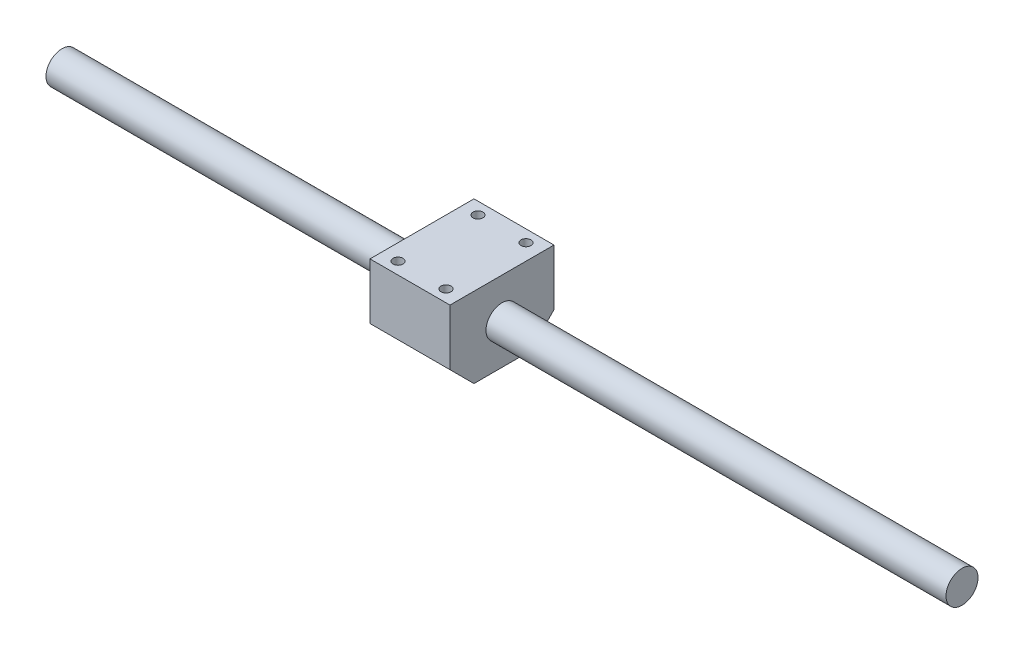
ISO-10303-21;
HEADER;
FILE_DESCRIPTION(('STEP AP214'),'2;1');
FILE_NAME('part.step','',(''),(''),'','','');
FILE_SCHEMA(('AUTOMOTIVE_DESIGN { 1 0 10303 214 1 1 1 1 }'));
ENDSEC;
DATA;
#1=APPLICATION_CONTEXT('core data for automotive mechanical design processes');
#2=APPLICATION_PROTOCOL_DEFINITION('international standard','automotive_design',2000,#1);
#3=PRODUCT_CONTEXT('',#1,'mechanical');
#4=PRODUCT('Part','Part','',(#3));
#5=PRODUCT_RELATED_PRODUCT_CATEGORY('part','',(#4));
#6=PRODUCT_DEFINITION_FORMATION('','',#4);
#7=PRODUCT_DEFINITION_CONTEXT('part definition',#1,'design');
#8=PRODUCT_DEFINITION('design','',#6,#7);
#9=PRODUCT_DEFINITION_SHAPE('','',#8);
#10=(LENGTH_UNIT() NAMED_UNIT(*) SI_UNIT(.MILLI.,.METRE.));
#11=(NAMED_UNIT(*) PLANE_ANGLE_UNIT() SI_UNIT($,.RADIAN.));
#12=(NAMED_UNIT(*) SI_UNIT($,.STERADIAN.) SOLID_ANGLE_UNIT());
#13=UNCERTAINTY_MEASURE_WITH_UNIT(LENGTH_MEASURE(1.E-05),#10,'distance_accuracy_value','');
#14=(GEOMETRIC_REPRESENTATION_CONTEXT(3) GLOBAL_UNCERTAINTY_ASSIGNED_CONTEXT((#13)) GLOBAL_UNIT_ASSIGNED_CONTEXT((#10,
#11,#12)) REPRESENTATION_CONTEXT('',''));
#15=CARTESIAN_POINT('',(0.,0.,0.));
#16=DIRECTION('',(0.,0.,1.));
#17=DIRECTION('',(1.,0.,0.));
#18=AXIS2_PLACEMENT_3D('',#15,#16,#17);
#19=CARTESIAN_POINT('',(450.,0.,0.));
#20=DIRECTION('',(-1.,0.,0.));
#21=DIRECTION('',(0.,0.,1.));
#22=AXIS2_PLACEMENT_3D('',#19,#20,#21);
#23=CYLINDRICAL_SURFACE('',#22,8.);
#24=CARTESIAN_POINT('',(0.,0.,0.));
#25=DIRECTION('',(1.,0.,0.));
#26=DIRECTION('',(0.,0.,-1.));
#27=AXIS2_PLACEMENT_3D('',#24,#25,#26);
#28=CIRCLE('',#27,8.);
#29=CARTESIAN_POINT('',(0.,0.,-8.));
#30=VERTEX_POINT('',#29);
#31=EDGE_CURVE('E114',#30,#30,#28,.T.);
#32=ORIENTED_EDGE('',*,*,#31,.T.);
#33=EDGE_LOOP('',(#32));
#34=FACE_BOUND('',#33,.T.);
#35=CARTESIAN_POINT('',(180.,0.,0.));
#36=DIRECTION('',(1.,0.,0.));
#37=DIRECTION('',(0.,0.,-1.));
#38=AXIS2_PLACEMENT_3D('',#35,#36,#37);
#39=CIRCLE('',#38,8.);
#40=CARTESIAN_POINT('',(180.,0.,-8.));
#41=VERTEX_POINT('',#40);
#42=EDGE_CURVE('E128',#41,#41,#39,.T.);
#43=ORIENTED_EDGE('',*,*,#42,.F.);
#44=EDGE_LOOP('',(#43));
#45=FACE_BOUND('',#44,.T.);
#46=ADVANCED_FACE('F33',(#34,#45),#23,.T.);
#47=CARTESIAN_POINT('',(0.,0.,0.));
#48=DIRECTION('',(1.,0.,0.));
#49=DIRECTION('',(0.,0.,-1.));
#50=AXIS2_PLACEMENT_3D('',#47,#48,#49);
#51=PLANE('',#50);
#52=ORIENTED_EDGE('',*,*,#31,.F.);
#53=EDGE_LOOP('',(#52));
#54=FACE_BOUND('',#53,.T.);
#55=ADVANCED_FACE('F216',(#54),#51,.F.);
#56=CARTESIAN_POINT('',(180.,20.,26.));
#57=DIRECTION('',(1.,0.,0.));
#58=DIRECTION('',(0.,0.,-1.));
#59=AXIS2_PLACEMENT_3D('',#56,#57,#58);
#60=PLANE('',#59);
#61=DIRECTION('',(0.,0.,1.));
#62=VECTOR('',#61,1.);
#63=CARTESIAN_POINT('',(180.,-20.,26.));
#64=LINE('',#63,#62);
#65=CARTESIAN_POINT('',(180.,-20.,-13.9999999999999));
#66=VERTEX_POINT('',#65);
#67=CARTESIAN_POINT('',(180.,-20.,14.));
#68=VERTEX_POINT('',#67);
#69=EDGE_CURVE('E140',#66,#68,#64,.T.);
#70=ORIENTED_EDGE('',*,*,#69,.T.);
#71=DIRECTION('',(0.,-0.707106781186546,-0.707106781186549));
#72=VECTOR('',#71,1.);
#73=CARTESIAN_POINT('',(180.,-8.00000000000005,26.));
#74=LINE('',#73,#72);
#75=CARTESIAN_POINT('',(180.,-8.00000000000004,26.));
#76=VERTEX_POINT('',#75);
#77=EDGE_CURVE('E41',#68,#76,#74,.F.);
#78=ORIENTED_EDGE('',*,*,#77,.T.);
#79=DIRECTION('',(0.,-1.,0.));
#80=VECTOR('',#79,1.);
#81=CARTESIAN_POINT('',(180.,20.,26.));
#82=LINE('',#81,#80);
#83=CARTESIAN_POINT('',(180.,20.,26.));
#84=VERTEX_POINT('',#83);
#85=EDGE_CURVE('E93',#84,#76,#82,.T.);
#86=ORIENTED_EDGE('',*,*,#85,.F.);
#87=DIRECTION('',(0.,0.,1.));
#88=VECTOR('',#87,1.);
#89=CARTESIAN_POINT('',(180.,20.,26.));
#90=LINE('',#89,#88);
#91=CARTESIAN_POINT('',(180.,20.,-26.));
#92=VERTEX_POINT('',#91);
#93=EDGE_CURVE('E100',#92,#84,#90,.T.);
#94=ORIENTED_EDGE('',*,*,#93,.F.);
#95=DIRECTION('',(0.,-1.,0.));
#96=VECTOR('',#95,1.);
#97=CARTESIAN_POINT('',(180.,20.,-26.));
#98=LINE('',#97,#96);
#99=CARTESIAN_POINT('',(180.,-7.99999999999999,-26.));
#100=VERTEX_POINT('',#99);
#101=EDGE_CURVE('E141',#92,#100,#98,.T.);
#102=ORIENTED_EDGE('',*,*,#101,.T.);
#103=DIRECTION('',(0.,0.707106781186546,-0.707106781186549));
#104=VECTOR('',#103,1.);
#105=CARTESIAN_POINT('',(180.,-7.99999999999999,-26.));
#106=LINE('',#105,#104);
#107=EDGE_CURVE('E48',#100,#66,#106,.F.);
#108=ORIENTED_EDGE('',*,*,#107,.T.);
#109=EDGE_LOOP('',(#70,#78,#86,#94,#102,#108));
#110=FACE_BOUND('',#109,.T.);
#111=ORIENTED_EDGE('',*,*,#42,.T.);
#112=EDGE_LOOP('',(#111));
#113=FACE_BOUND('',#112,.T.);
#114=ADVANCED_FACE('F111',(#110,#113),#60,.F.);
#115=CARTESIAN_POINT('',(220.,20.,26.));
#116=DIRECTION('',(-1.,0.,0.));
#117=DIRECTION('',(0.,0.,1.));
#118=AXIS2_PLACEMENT_3D('',#115,#116,#117);
#119=PLANE('',#118);
#120=DIRECTION('',(0.,-1.,0.));
#121=VECTOR('',#120,1.);
#122=CARTESIAN_POINT('',(220.,20.,26.));
#123=LINE('',#122,#121);
#124=CARTESIAN_POINT('',(220.,20.,26.));
#125=VERTEX_POINT('',#124);
#126=CARTESIAN_POINT('',(220.,-8.00000000000004,26.));
#127=VERTEX_POINT('',#126);
#128=EDGE_CURVE('E96',#125,#127,#123,.T.);
#129=ORIENTED_EDGE('',*,*,#128,.T.);
#130=DIRECTION('',(0.,0.707106781186546,0.707106781186549));
#131=VECTOR('',#130,1.);
#132=CARTESIAN_POINT('',(220.,-8.00000000000004,26.));
#133=LINE('',#132,#131);
#134=CARTESIAN_POINT('',(220.,-20.,14.));
#135=VERTEX_POINT('',#134);
#136=EDGE_CURVE('E135',#127,#135,#133,.F.);
#137=ORIENTED_EDGE('',*,*,#136,.T.);
#138=DIRECTION('',(0.,0.,-1.));
#139=VECTOR('',#138,1.);
#140=CARTESIAN_POINT('',(220.,-20.,26.));
#141=LINE('',#140,#139);
#142=CARTESIAN_POINT('',(220.,-20.,-13.9999999999999));
#143=VERTEX_POINT('',#142);
#144=EDGE_CURVE('E109',#135,#143,#141,.T.);
#145=ORIENTED_EDGE('',*,*,#144,.T.);
#146=DIRECTION('',(0.,-0.707106781186546,0.707106781186549));
#147=VECTOR('',#146,1.);
#148=CARTESIAN_POINT('',(220.,-7.99999999999999,-26.));
#149=LINE('',#148,#147);
#150=CARTESIAN_POINT('',(220.,-7.99999999999999,-26.));
#151=VERTEX_POINT('',#150);
#152=EDGE_CURVE('E133',#143,#151,#149,.F.);
#153=ORIENTED_EDGE('',*,*,#152,.T.);
#154=DIRECTION('',(0.,-1.,0.));
#155=VECTOR('',#154,1.);
#156=CARTESIAN_POINT('',(220.,20.,-26.));
#157=LINE('',#156,#155);
#158=CARTESIAN_POINT('',(220.,20.,-26.));
#159=VERTEX_POINT('',#158);
#160=EDGE_CURVE('E119',#159,#151,#157,.T.);
#161=ORIENTED_EDGE('',*,*,#160,.F.);
#162=DIRECTION('',(0.,0.,-1.));
#163=VECTOR('',#162,1.);
#164=CARTESIAN_POINT('',(220.,20.,26.));
#165=LINE('',#164,#163);
#166=EDGE_CURVE('E99',#125,#159,#165,.T.);
#167=ORIENTED_EDGE('',*,*,#166,.F.);
#168=EDGE_LOOP('',(#129,#137,#145,#153,#161,#167));
#169=FACE_BOUND('',#168,.T.);
#170=CARTESIAN_POINT('',(220.,0.,0.));
#171=DIRECTION('',(-1.,0.,0.));
#172=DIRECTION('',(0.,0.,1.));
#173=AXIS2_PLACEMENT_3D('',#170,#171,#172);
#174=CIRCLE('',#173,8.);
#175=CARTESIAN_POINT('',(220.,0.,8.));
#176=VERTEX_POINT('',#175);
#177=EDGE_CURVE('E124',#176,#176,#174,.T.);
#178=ORIENTED_EDGE('',*,*,#177,.T.);
#179=EDGE_LOOP('',(#178));
#180=FACE_BOUND('',#179,.T.);
#181=ADVANCED_FACE('F150',(#169,#180),#119,.F.);
#182=CARTESIAN_POINT('',(220.,20.,26.));
#183=DIRECTION('',(0.,0.,-1.));
#184=DIRECTION('',(-1.,0.,0.));
#185=AXIS2_PLACEMENT_3D('',#182,#183,#184);
#186=PLANE('',#185);
#187=ORIENTED_EDGE('',*,*,#85,.T.);
#188=DIRECTION('',(1.,0.,0.));
#189=VECTOR('',#188,1.);
#190=CARTESIAN_POINT('',(220.,-8.00000000000004,26.));
#191=LINE('',#190,#189);
#192=EDGE_CURVE('E131',#76,#127,#191,.T.);
#193=ORIENTED_EDGE('',*,*,#192,.T.);
#194=ORIENTED_EDGE('',*,*,#128,.F.);
#195=DIRECTION('',(1.,0.,0.));
#196=VECTOR('',#195,1.);
#197=CARTESIAN_POINT('',(220.,20.,26.));
#198=LINE('',#197,#196);
#199=EDGE_CURVE('E88',#84,#125,#198,.T.);
#200=ORIENTED_EDGE('',*,*,#199,.F.);
#201=EDGE_LOOP('',(#187,#193,#194,#200));
#202=FACE_BOUND('',#201,.T.);
#203=ADVANCED_FACE('F90',(#202),#186,.F.);
#204=CARTESIAN_POINT('',(220.,20.,-26.));
#205=DIRECTION('',(0.,0.,1.));
#206=DIRECTION('',(1.,0.,0.));
#207=AXIS2_PLACEMENT_3D('',#204,#205,#206);
#208=PLANE('',#207);
#209=ORIENTED_EDGE('',*,*,#160,.T.);
#210=DIRECTION('',(-1.,0.,0.));
#211=VECTOR('',#210,1.);
#212=CARTESIAN_POINT('',(220.,-7.99999999999999,-26.));
#213=LINE('',#212,#211);
#214=EDGE_CURVE('E11',#151,#100,#213,.T.);
#215=ORIENTED_EDGE('',*,*,#214,.T.);
#216=ORIENTED_EDGE('',*,*,#101,.F.);
#217=DIRECTION('',(-1.,0.,0.));
#218=VECTOR('',#217,1.);
#219=CARTESIAN_POINT('',(220.,20.,-26.));
#220=LINE('',#219,#218);
#221=EDGE_CURVE('E105',#159,#92,#220,.T.);
#222=ORIENTED_EDGE('',*,*,#221,.F.);
#223=EDGE_LOOP('',(#209,#215,#216,#222));
#224=FACE_BOUND('',#223,.T.);
#225=ADVANCED_FACE('F153',(#224),#208,.F.);
#226=CARTESIAN_POINT('',(0.,20.,0.));
#227=DIRECTION('',(0.,1.,0.));
#228=DIRECTION('',(0.,0.,1.));
#229=AXIS2_PLACEMENT_3D('',#226,#227,#228);
#230=PLANE('',#229);
#231=CARTESIAN_POINT('',(212.,20.,20.));
#232=DIRECTION('',(0.,1.,0.));
#233=DIRECTION('',(0.,0.,1.));
#234=AXIS2_PLACEMENT_3D('',#231,#232,#233);
#235=CIRCLE('',#234,2.50000000000002);
#236=CARTESIAN_POINT('',(212.,20.,22.5));
#237=VERTEX_POINT('',#236);
#238=EDGE_CURVE('E177',#237,#237,#235,.T.);
#239=ORIENTED_EDGE('',*,*,#238,.F.);
#240=EDGE_LOOP('',(#239));
#241=FACE_BOUND('',#240,.T.);
#242=CARTESIAN_POINT('',(188.,20.,20.));
#243=DIRECTION('',(0.,1.,0.));
#244=DIRECTION('',(0.,0.,1.));
#245=AXIS2_PLACEMENT_3D('',#242,#243,#244);
#246=CIRCLE('',#245,2.5);
#247=CARTESIAN_POINT('',(188.,20.,22.5));
#248=VERTEX_POINT('',#247);
#249=EDGE_CURVE('E171',#248,#248,#246,.T.);
#250=ORIENTED_EDGE('',*,*,#249,.F.);
#251=EDGE_LOOP('',(#250));
#252=FACE_BOUND('',#251,.T.);
#253=CARTESIAN_POINT('',(212.,20.,-20.));
#254=DIRECTION('',(0.,1.,0.));
#255=DIRECTION('',(0.,0.,1.));
#256=AXIS2_PLACEMENT_3D('',#253,#254,#255);
#257=CIRCLE('',#256,2.50000000000002);
#258=CARTESIAN_POINT('',(212.,20.,-17.5));
#259=VERTEX_POINT('',#258);
#260=EDGE_CURVE('E165',#259,#259,#257,.T.);
#261=ORIENTED_EDGE('',*,*,#260,.F.);
#262=EDGE_LOOP('',(#261));
#263=FACE_BOUND('',#262,.T.);
#264=CARTESIAN_POINT('',(188.,20.,-20.));
#265=DIRECTION('',(0.,1.,0.));
#266=DIRECTION('',(0.,0.,1.));
#267=AXIS2_PLACEMENT_3D('',#264,#265,#266);
#268=CIRCLE('',#267,2.5);
#269=CARTESIAN_POINT('',(188.,20.,-17.5));
#270=VERTEX_POINT('',#269);
#271=EDGE_CURVE('E159',#270,#270,#268,.T.);
#272=ORIENTED_EDGE('',*,*,#271,.F.);
#273=EDGE_LOOP('',(#272));
#274=FACE_BOUND('',#273,.T.);
#275=ORIENTED_EDGE('',*,*,#93,.T.);
#276=ORIENTED_EDGE('',*,*,#199,.T.);
#277=ORIENTED_EDGE('',*,*,#166,.T.);
#278=ORIENTED_EDGE('',*,*,#221,.T.);
#279=EDGE_LOOP('',(#275,#276,#277,#278));
#280=FACE_BOUND('',#279,.T.);
#281=ADVANCED_FACE('F103',(#241,#252,#263,#274,#280),#230,.T.);
#282=CARTESIAN_POINT('',(0.,-20.,0.));
#283=DIRECTION('',(0.,1.,0.));
#284=DIRECTION('',(0.,0.,1.));
#285=AXIS2_PLACEMENT_3D('',#282,#283,#284);
#286=PLANE('',#285);
#287=ORIENTED_EDGE('',*,*,#144,.F.);
#288=DIRECTION('',(-1.,0.,0.));
#289=VECTOR('',#288,1.);
#290=CARTESIAN_POINT('',(0.,-20.,14.));
#291=LINE('',#290,#289);
#292=EDGE_CURVE('E55',#135,#68,#291,.T.);
#293=ORIENTED_EDGE('',*,*,#292,.T.);
#294=ORIENTED_EDGE('',*,*,#69,.F.);
#295=DIRECTION('',(1.,0.,0.));
#296=VECTOR('',#295,1.);
#297=CARTESIAN_POINT('',(0.,-20.,-13.9999999999999));
#298=LINE('',#297,#296);
#299=EDGE_CURVE('E137',#66,#143,#298,.T.);
#300=ORIENTED_EDGE('',*,*,#299,.T.);
#301=EDGE_LOOP('',(#287,#293,#294,#300));
#302=FACE_BOUND('',#301,.T.);
#303=ADVANCED_FACE('F142',(#302),#286,.F.);
#304=CARTESIAN_POINT('',(450.,0.,0.));
#305=DIRECTION('',(1.,0.,0.));
#306=DIRECTION('',(0.,0.,-1.));
#307=AXIS2_PLACEMENT_3D('',#304,#305,#306);
#308=PLANE('',#307);
#309=CARTESIAN_POINT('',(450.,0.,0.));
#310=DIRECTION('',(1.,0.,0.));
#311=DIRECTION('',(0.,0.,-1.));
#312=AXIS2_PLACEMENT_3D('',#309,#310,#311);
#313=CIRCLE('',#312,8.);
#314=CARTESIAN_POINT('',(450.,0.,-8.));
#315=VERTEX_POINT('',#314);
#316=EDGE_CURVE('E117',#315,#315,#313,.T.);
#317=ORIENTED_EDGE('',*,*,#316,.T.);
#318=EDGE_LOOP('',(#317));
#319=FACE_BOUND('',#318,.T.);
#320=ADVANCED_FACE('F227',(#319),#308,.T.);
#321=ORIENTED_EDGE('',*,*,#316,.F.);
#322=EDGE_LOOP('',(#321));
#323=FACE_BOUND('',#322,.T.);
#324=ORIENTED_EDGE('',*,*,#177,.F.);
#325=EDGE_LOOP('',(#324));
#326=FACE_BOUND('',#325,.T.);
#327=ADVANCED_FACE('F219',(#323,#326),#23,.T.);
#328=CARTESIAN_POINT('',(220.,-8.00000000000004,26.));
#329=DIRECTION('',(0.,0.707106781186549,-0.707106781186546));
#330=DIRECTION('',(1.,0.,0.));
#331=AXIS2_PLACEMENT_3D('',#328,#329,#330);
#332=PLANE('',#331);
#333=ORIENTED_EDGE('',*,*,#77,.F.);
#334=ORIENTED_EDGE('',*,*,#292,.F.);
#335=ORIENTED_EDGE('',*,*,#136,.F.);
#336=ORIENTED_EDGE('',*,*,#192,.F.);
#337=EDGE_LOOP('',(#333,#334,#335,#336));
#338=FACE_BOUND('',#337,.T.);
#339=ADVANCED_FACE('F213',(#338),#332,.F.);
#340=CARTESIAN_POINT('',(220.,-7.99999999999999,-26.));
#341=DIRECTION('',(0.,0.707106781186549,0.707106781186546));
#342=DIRECTION('',(-1.,0.,0.));
#343=AXIS2_PLACEMENT_3D('',#340,#341,#342);
#344=PLANE('',#343);
#345=ORIENTED_EDGE('',*,*,#152,.F.);
#346=ORIENTED_EDGE('',*,*,#299,.F.);
#347=ORIENTED_EDGE('',*,*,#107,.F.);
#348=ORIENTED_EDGE('',*,*,#214,.F.);
#349=EDGE_LOOP('',(#345,#346,#347,#348));
#350=FACE_BOUND('',#349,.T.);
#351=ADVANCED_FACE('F35',(#350),#344,.F.);
#352=CARTESIAN_POINT('',(188.,10.,-20.));
#353=DIRECTION('',(0.,1.,0.));
#354=DIRECTION('',(0.,0.,1.));
#355=AXIS2_PLACEMENT_3D('',#352,#353,#354);
#356=CYLINDRICAL_SURFACE('',#355,2.5);
#357=CARTESIAN_POINT('',(188.,10.,-20.));
#358=DIRECTION('',(0.,1.,0.));
#359=DIRECTION('',(0.,0.,1.));
#360=AXIS2_PLACEMENT_3D('',#357,#358,#359);
#361=CIRCLE('',#360,2.5);
#362=CARTESIAN_POINT('',(188.,10.,-17.5));
#363=VERTEX_POINT('',#362);
#364=EDGE_CURVE('E144',#363,#363,#361,.T.);
#365=ORIENTED_EDGE('',*,*,#364,.F.);
#366=EDGE_LOOP('',(#365));
#367=FACE_BOUND('',#366,.T.);
#368=ORIENTED_EDGE('',*,*,#271,.T.);
#369=EDGE_LOOP('',(#368));
#370=FACE_BOUND('',#369,.T.);
#371=ADVANCED_FACE('F201',(#367,#370),#356,.F.);
#372=CARTESIAN_POINT('',(188.,10.,-20.));
#373=DIRECTION('',(0.,1.,0.));
#374=DIRECTION('',(0.,0.,1.));
#375=AXIS2_PLACEMENT_3D('',#372,#373,#374);
#376=PLANE('',#375);
#377=ORIENTED_EDGE('',*,*,#364,.T.);
#378=EDGE_LOOP('',(#377));
#379=FACE_BOUND('',#378,.T.);
#380=ADVANCED_FACE('F203',(#379),#376,.T.);
#381=CARTESIAN_POINT('',(212.,10.,-20.));
#382=DIRECTION('',(0.,1.,0.));
#383=DIRECTION('',(0.,0.,1.));
#384=AXIS2_PLACEMENT_3D('',#381,#382,#383);
#385=CYLINDRICAL_SURFACE('',#384,2.50000000000002);
#386=CARTESIAN_POINT('',(212.,10.,-20.));
#387=DIRECTION('',(0.,1.,0.));
#388=DIRECTION('',(0.,0.,1.));
#389=AXIS2_PLACEMENT_3D('',#386,#387,#388);
#390=CIRCLE('',#389,2.50000000000002);
#391=CARTESIAN_POINT('',(212.,10.,-17.5));
#392=VERTEX_POINT('',#391);
#393=EDGE_CURVE('E162',#392,#392,#390,.T.);
#394=ORIENTED_EDGE('',*,*,#393,.F.);
#395=EDGE_LOOP('',(#394));
#396=FACE_BOUND('',#395,.T.);
#397=ORIENTED_EDGE('',*,*,#260,.T.);
#398=EDGE_LOOP('',(#397));
#399=FACE_BOUND('',#398,.T.);
#400=ADVANCED_FACE('F210',(#396,#399),#385,.F.);
#401=CARTESIAN_POINT('',(212.,10.,-20.));
#402=DIRECTION('',(0.,1.,0.));
#403=DIRECTION('',(0.,0.,1.));
#404=AXIS2_PLACEMENT_3D('',#401,#402,#403);
#405=PLANE('',#404);
#406=ORIENTED_EDGE('',*,*,#393,.T.);
#407=EDGE_LOOP('',(#406));
#408=FACE_BOUND('',#407,.T.);
#409=ADVANCED_FACE('F330',(#408),#405,.T.);
#410=CARTESIAN_POINT('',(188.,10.,20.));
#411=DIRECTION('',(0.,1.,0.));
#412=DIRECTION('',(0.,0.,1.));
#413=AXIS2_PLACEMENT_3D('',#410,#411,#412);
#414=CYLINDRICAL_SURFACE('',#413,2.5);
#415=CARTESIAN_POINT('',(188.,10.,20.));
#416=DIRECTION('',(0.,1.,0.));
#417=DIRECTION('',(0.,0.,1.));
#418=AXIS2_PLACEMENT_3D('',#415,#416,#417);
#419=CIRCLE('',#418,2.5);
#420=CARTESIAN_POINT('',(188.,10.,22.5));
#421=VERTEX_POINT('',#420);
#422=EDGE_CURVE('E168',#421,#421,#419,.T.);
#423=ORIENTED_EDGE('',*,*,#422,.F.);
#424=EDGE_LOOP('',(#423));
#425=FACE_BOUND('',#424,.T.);
#426=ORIENTED_EDGE('',*,*,#249,.T.);
#427=EDGE_LOOP('',(#426));
#428=FACE_BOUND('',#427,.T.);
#429=ADVANCED_FACE('F339',(#425,#428),#414,.F.);
#430=CARTESIAN_POINT('',(188.,10.,20.));
#431=DIRECTION('',(0.,1.,0.));
#432=DIRECTION('',(0.,0.,1.));
#433=AXIS2_PLACEMENT_3D('',#430,#431,#432);
#434=PLANE('',#433);
#435=ORIENTED_EDGE('',*,*,#422,.T.);
#436=EDGE_LOOP('',(#435));
#437=FACE_BOUND('',#436,.T.);
#438=ADVANCED_FACE('F188',(#437),#434,.T.);
#439=CARTESIAN_POINT('',(212.,10.,20.));
#440=DIRECTION('',(0.,1.,0.));
#441=DIRECTION('',(0.,0.,1.));
#442=AXIS2_PLACEMENT_3D('',#439,#440,#441);
#443=CYLINDRICAL_SURFACE('',#442,2.50000000000002);
#444=CARTESIAN_POINT('',(212.,10.,20.));
#445=DIRECTION('',(0.,1.,0.));
#446=DIRECTION('',(0.,0.,1.));
#447=AXIS2_PLACEMENT_3D('',#444,#445,#446);
#448=CIRCLE('',#447,2.50000000000002);
#449=CARTESIAN_POINT('',(212.,10.,22.5));
#450=VERTEX_POINT('',#449);
#451=EDGE_CURVE('E174',#450,#450,#448,.T.);
#452=ORIENTED_EDGE('',*,*,#451,.F.);
#453=EDGE_LOOP('',(#452));
#454=FACE_BOUND('',#453,.T.);
#455=ORIENTED_EDGE('',*,*,#238,.T.);
#456=EDGE_LOOP('',(#455));
#457=FACE_BOUND('',#456,.T.);
#458=ADVANCED_FACE('F185',(#454,#457),#443,.F.);
#459=CARTESIAN_POINT('',(212.,10.,20.));
#460=DIRECTION('',(0.,1.,0.));
#461=DIRECTION('',(0.,0.,1.));
#462=AXIS2_PLACEMENT_3D('',#459,#460,#461);
#463=PLANE('',#462);
#464=ORIENTED_EDGE('',*,*,#451,.T.);
#465=EDGE_LOOP('',(#464));
#466=FACE_BOUND('',#465,.T.);
#467=ADVANCED_FACE('F183',(#466),#463,.T.);
#468=CLOSED_SHELL('',(#46,#55,#114,#181,#203,#225,#281,#303,#320,#327,#339,#351,#371,#380,#400,
#409,#429,#438,#458,#467));
#469=MANIFOLD_SOLID_BREP('B2',#468);
#470=ADVANCED_BREP_SHAPE_REPRESENTATION('',(#18,#469),#14);
#471=SHAPE_DEFINITION_REPRESENTATION(#9,#470);
ENDSEC;
END-ISO-10303-21;
